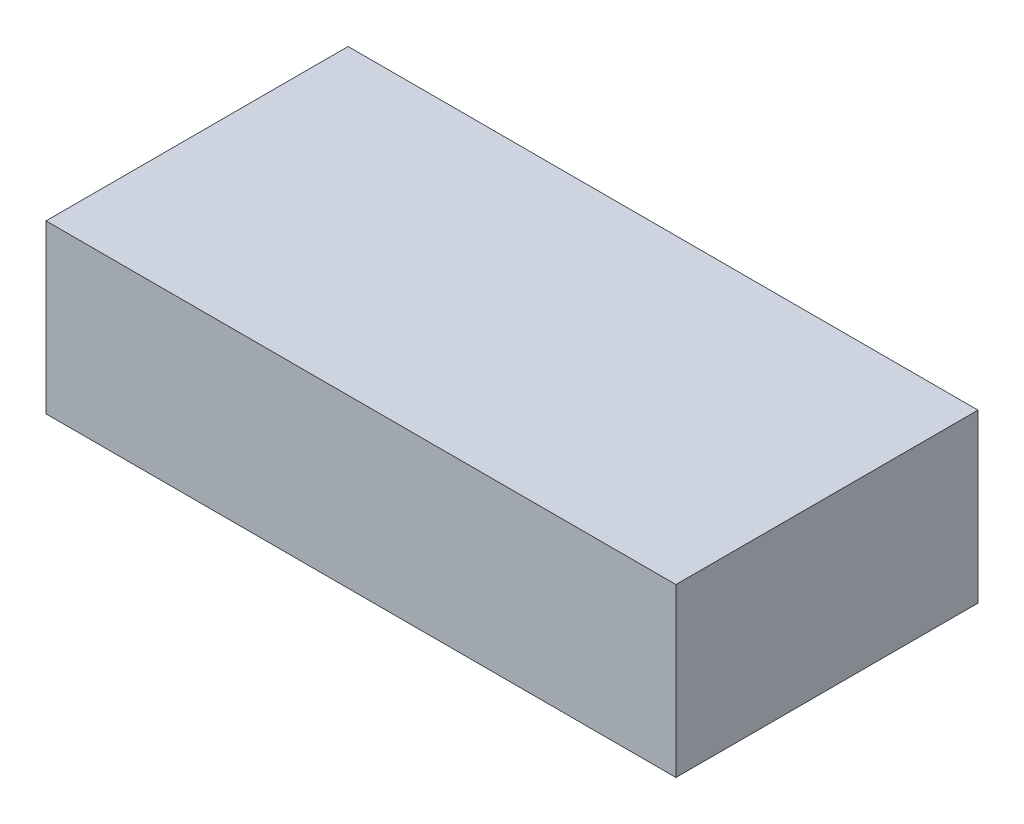
ISO-10303-21;
HEADER;
FILE_DESCRIPTION(('STEP AP214'),'2;1');
FILE_NAME('part.step','',(''),(''),'','','');
FILE_SCHEMA(('AUTOMOTIVE_DESIGN { 1 0 10303 214 1 1 1 1 }'));
ENDSEC;
DATA;
#1=APPLICATION_CONTEXT('core data for automotive mechanical design processes');
#2=APPLICATION_PROTOCOL_DEFINITION('international standard','automotive_design',2000,#1);
#3=PRODUCT_CONTEXT('',#1,'mechanical');
#4=PRODUCT('Part','Part','',(#3));
#5=PRODUCT_RELATED_PRODUCT_CATEGORY('part','',(#4));
#6=PRODUCT_DEFINITION_FORMATION('','',#4);
#7=PRODUCT_DEFINITION_CONTEXT('part definition',#1,'design');
#8=PRODUCT_DEFINITION('design','',#6,#7);
#9=PRODUCT_DEFINITION_SHAPE('','',#8);
#10=(LENGTH_UNIT() NAMED_UNIT(*) SI_UNIT(.MILLI.,.METRE.));
#11=(NAMED_UNIT(*) PLANE_ANGLE_UNIT() SI_UNIT($,.RADIAN.));
#12=(NAMED_UNIT(*) SI_UNIT($,.STERADIAN.) SOLID_ANGLE_UNIT());
#13=UNCERTAINTY_MEASURE_WITH_UNIT(LENGTH_MEASURE(1.E-05),#10,'distance_accuracy_value','');
#14=(GEOMETRIC_REPRESENTATION_CONTEXT(3) GLOBAL_UNCERTAINTY_ASSIGNED_CONTEXT((#13)) GLOBAL_UNIT_ASSIGNED_CONTEXT((#10,
#11,#12)) REPRESENTATION_CONTEXT('',''));
#15=CARTESIAN_POINT('',(0.,0.,0.));
#16=DIRECTION('',(0.,0.,1.));
#17=DIRECTION('',(1.,0.,0.));
#18=AXIS2_PLACEMENT_3D('',#15,#16,#17);
#19=CARTESIAN_POINT('',(24.5,13.,11.75));
#20=DIRECTION('',(-1.,0.,0.));
#21=DIRECTION('',(0.,0.,1.));
#22=AXIS2_PLACEMENT_3D('',#19,#20,#21);
#23=PLANE('',#22);
#24=DIRECTION('',(0.,0.,-1.));
#25=VECTOR('',#24,1.);
#26=CARTESIAN_POINT('',(24.5,0.,11.75));
#27=LINE('',#26,#25);
#28=CARTESIAN_POINT('',(24.5,0.,11.75));
#29=VERTEX_POINT('',#28);
#30=CARTESIAN_POINT('',(24.5,0.,-11.75));
#31=VERTEX_POINT('',#30);
#32=EDGE_CURVE('E95',#29,#31,#27,.T.);
#33=ORIENTED_EDGE('',*,*,#32,.T.);
#34=DIRECTION('',(0.,-1.,0.));
#35=VECTOR('',#34,1.);
#36=CARTESIAN_POINT('',(24.5,13.,-11.75));
#37=LINE('',#36,#35);
#38=CARTESIAN_POINT('',(24.5,13.,-11.75));
#39=VERTEX_POINT('',#38);
#40=EDGE_CURVE('E11',#39,#31,#37,.T.);
#41=ORIENTED_EDGE('',*,*,#40,.F.);
#42=DIRECTION('',(0.,0.,-1.));
#43=VECTOR('',#42,1.);
#44=CARTESIAN_POINT('',(24.5,13.,11.75));
#45=LINE('',#44,#43);
#46=CARTESIAN_POINT('',(24.5,13.,11.75));
#47=VERTEX_POINT('',#46);
#48=EDGE_CURVE('E83',#47,#39,#45,.T.);
#49=ORIENTED_EDGE('',*,*,#48,.F.);
#50=DIRECTION('',(0.,-1.,0.));
#51=VECTOR('',#50,1.);
#52=CARTESIAN_POINT('',(24.5,13.,11.75));
#53=LINE('',#52,#51);
#54=EDGE_CURVE('E91',#47,#29,#53,.T.);
#55=ORIENTED_EDGE('',*,*,#54,.T.);
#56=EDGE_LOOP('',(#33,#41,#49,#55));
#57=FACE_BOUND('',#56,.T.);
#58=ADVANCED_FACE('F32',(#57),#23,.F.);
#59=CARTESIAN_POINT('',(-24.5,13.,-11.75));
#60=DIRECTION('',(0.,0.,1.));
#61=DIRECTION('',(1.,0.,0.));
#62=AXIS2_PLACEMENT_3D('',#59,#60,#61);
#63=PLANE('',#62);
#64=DIRECTION('',(-1.,0.,0.));
#65=VECTOR('',#64,1.);
#66=CARTESIAN_POINT('',(-24.5,0.,-11.75));
#67=LINE('',#66,#65);
#68=CARTESIAN_POINT('',(-24.5,0.,-11.75));
#69=VERTEX_POINT('',#68);
#70=EDGE_CURVE('E87',#31,#69,#67,.T.);
#71=ORIENTED_EDGE('',*,*,#70,.T.);
#72=DIRECTION('',(0.,-1.,0.));
#73=VECTOR('',#72,1.);
#74=CARTESIAN_POINT('',(-24.5,13.,-11.75));
#75=LINE('',#74,#73);
#76=CARTESIAN_POINT('',(-24.5,13.,-11.75));
#77=VERTEX_POINT('',#76);
#78=EDGE_CURVE('E40',#77,#69,#75,.T.);
#79=ORIENTED_EDGE('',*,*,#78,.F.);
#80=DIRECTION('',(-1.,0.,0.));
#81=VECTOR('',#80,1.);
#82=CARTESIAN_POINT('',(-24.5,13.,-11.75));
#83=LINE('',#82,#81);
#84=EDGE_CURVE('E78',#39,#77,#83,.T.);
#85=ORIENTED_EDGE('',*,*,#84,.F.);
#86=ORIENTED_EDGE('',*,*,#40,.T.);
#87=EDGE_LOOP('',(#71,#79,#85,#86));
#88=FACE_BOUND('',#87,.T.);
#89=ADVANCED_FACE('F86',(#88),#63,.F.);
#90=CARTESIAN_POINT('',(-24.5,13.,11.75));
#91=DIRECTION('',(1.,0.,0.));
#92=DIRECTION('',(0.,0.,-1.));
#93=AXIS2_PLACEMENT_3D('',#90,#91,#92);
#94=PLANE('',#93);
#95=DIRECTION('',(0.,0.,1.));
#96=VECTOR('',#95,1.);
#97=CARTESIAN_POINT('',(-24.5,0.,11.75));
#98=LINE('',#97,#96);
#99=CARTESIAN_POINT('',(-24.5,0.,11.75));
#100=VERTEX_POINT('',#99);
#101=EDGE_CURVE('E65',#69,#100,#98,.T.);
#102=ORIENTED_EDGE('',*,*,#101,.T.);
#103=DIRECTION('',(0.,-1.,0.));
#104=VECTOR('',#103,1.);
#105=CARTESIAN_POINT('',(-24.5,13.,11.75));
#106=LINE('',#105,#104);
#107=CARTESIAN_POINT('',(-24.5,13.,11.75));
#108=VERTEX_POINT('',#107);
#109=EDGE_CURVE('E88',#108,#100,#106,.T.);
#110=ORIENTED_EDGE('',*,*,#109,.F.);
#111=DIRECTION('',(0.,0.,1.));
#112=VECTOR('',#111,1.);
#113=CARTESIAN_POINT('',(-24.5,13.,11.75));
#114=LINE('',#113,#112);
#115=EDGE_CURVE('E81',#77,#108,#114,.T.);
#116=ORIENTED_EDGE('',*,*,#115,.F.);
#117=ORIENTED_EDGE('',*,*,#78,.T.);
#118=EDGE_LOOP('',(#102,#110,#116,#117));
#119=FACE_BOUND('',#118,.T.);
#120=ADVANCED_FACE('F89',(#119),#94,.F.);
#121=CARTESIAN_POINT('',(-24.5,13.,11.75));
#122=DIRECTION('',(0.,0.,-1.));
#123=DIRECTION('',(-1.,0.,0.));
#124=AXIS2_PLACEMENT_3D('',#121,#122,#123);
#125=PLANE('',#124);
#126=DIRECTION('',(1.,0.,0.));
#127=VECTOR('',#126,1.);
#128=CARTESIAN_POINT('',(-24.5,0.,11.75));
#129=LINE('',#128,#127);
#130=EDGE_CURVE('E71',#100,#29,#129,.T.);
#131=ORIENTED_EDGE('',*,*,#130,.T.);
#132=ORIENTED_EDGE('',*,*,#54,.F.);
#133=DIRECTION('',(1.,0.,0.));
#134=VECTOR('',#133,1.);
#135=CARTESIAN_POINT('',(-24.5,13.,11.75));
#136=LINE('',#135,#134);
#137=EDGE_CURVE('E48',#108,#47,#136,.T.);
#138=ORIENTED_EDGE('',*,*,#137,.F.);
#139=ORIENTED_EDGE('',*,*,#109,.T.);
#140=EDGE_LOOP('',(#131,#132,#138,#139));
#141=FACE_BOUND('',#140,.T.);
#142=ADVANCED_FACE('F102',(#141),#125,.F.);
#143=CARTESIAN_POINT('',(0.,13.,0.));
#144=DIRECTION('',(0.,-1.,0.));
#145=DIRECTION('',(0.,0.,-1.));
#146=AXIS2_PLACEMENT_3D('',#143,#144,#145);
#147=PLANE('',#146);
#148=ORIENTED_EDGE('',*,*,#48,.T.);
#149=ORIENTED_EDGE('',*,*,#84,.T.);
#150=ORIENTED_EDGE('',*,*,#115,.T.);
#151=ORIENTED_EDGE('',*,*,#137,.T.);
#152=EDGE_LOOP('',(#148,#149,#150,#151));
#153=FACE_BOUND('',#152,.T.);
#154=ADVANCED_FACE('F79',(#153),#147,.F.);
#155=CARTESIAN_POINT('',(0.,0.,0.));
#156=DIRECTION('',(0.,-1.,0.));
#157=DIRECTION('',(0.,0.,-1.));
#158=AXIS2_PLACEMENT_3D('',#155,#156,#157);
#159=PLANE('',#158);
#160=ORIENTED_EDGE('',*,*,#32,.F.);
#161=ORIENTED_EDGE('',*,*,#130,.F.);
#162=ORIENTED_EDGE('',*,*,#101,.F.);
#163=ORIENTED_EDGE('',*,*,#70,.F.);
#164=EDGE_LOOP('',(#160,#161,#162,#163));
#165=FACE_BOUND('',#164,.T.);
#166=ADVANCED_FACE('F105',(#165),#159,.T.);
#167=CLOSED_SHELL('',(#58,#89,#120,#142,#154,#166));
#168=MANIFOLD_SOLID_BREP('B2',#167);
#169=ADVANCED_BREP_SHAPE_REPRESENTATION('',(#18,#168),#14);
#170=SHAPE_DEFINITION_REPRESENTATION(#9,#169);
ENDSEC;
END-ISO-10303-21;
